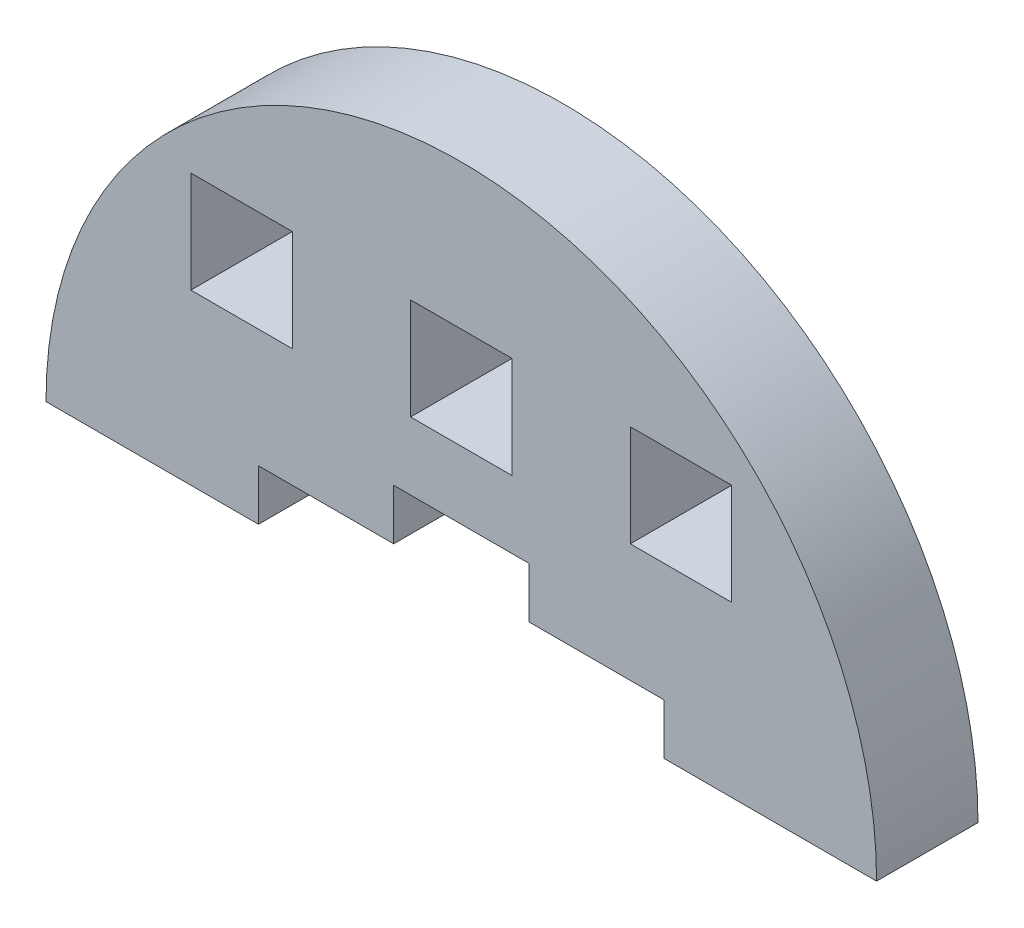
ISO-10303-21;
HEADER;
FILE_DESCRIPTION(('STEP AP214'),'2;1');
FILE_NAME('part.step','',(''),(''),'','','');
FILE_SCHEMA(('AUTOMOTIVE_DESIGN { 1 0 10303 214 1 1 1 1 }'));
ENDSEC;
DATA;
#1=APPLICATION_CONTEXT('core data for automotive mechanical design processes');
#2=APPLICATION_PROTOCOL_DEFINITION('international standard','automotive_design',2000,#1);
#3=PRODUCT_CONTEXT('',#1,'mechanical');
#4=PRODUCT('Part','Part','',(#3));
#5=PRODUCT_RELATED_PRODUCT_CATEGORY('part','',(#4));
#6=PRODUCT_DEFINITION_FORMATION('','',#4);
#7=PRODUCT_DEFINITION_CONTEXT('part definition',#1,'design');
#8=PRODUCT_DEFINITION('design','',#6,#7);
#9=PRODUCT_DEFINITION_SHAPE('','',#8);
#10=(LENGTH_UNIT() NAMED_UNIT(*) SI_UNIT(.MILLI.,.METRE.));
#11=(NAMED_UNIT(*) PLANE_ANGLE_UNIT() SI_UNIT($,.RADIAN.));
#12=(NAMED_UNIT(*) SI_UNIT($,.STERADIAN.) SOLID_ANGLE_UNIT());
#13=UNCERTAINTY_MEASURE_WITH_UNIT(LENGTH_MEASURE(1.E-05),#10,'distance_accuracy_value','');
#14=(GEOMETRIC_REPRESENTATION_CONTEXT(3) GLOBAL_UNCERTAINTY_ASSIGNED_CONTEXT((#13)) GLOBAL_UNIT_ASSIGNED_CONTEXT((#10,
#11,#12)) REPRESENTATION_CONTEXT('',''));
#15=CARTESIAN_POINT('',(0.,0.,0.));
#16=DIRECTION('',(0.,0.,1.));
#17=DIRECTION('',(1.,0.,0.));
#18=AXIS2_PLACEMENT_3D('',#15,#16,#17);
#19=CARTESIAN_POINT('',(3761.5255540209,1243.78177014644,6.));
#20=DIRECTION('',(0.,0.,1.));
#21=DIRECTION('',(1.,0.,0.));
#22=AXIS2_PLACEMENT_3D('',#19,#20,#21);
#23=PLANE('',#22);
#24=DIRECTION('',(0.,1.,0.));
#25=VECTOR('',#24,1.);
#26=CARTESIAN_POINT('',(3771.5255540209,0.,6.));
#27=LINE('',#26,#25);
#28=CARTESIAN_POINT('',(3771.5255540209,1253.78177014664,6.));
#29=VERTEX_POINT('',#28);
#30=CARTESIAN_POINT('',(3771.5255540209,1259.78177014664,6.));
#31=VERTEX_POINT('',#30);
#32=EDGE_CURVE('E363',#29,#31,#27,.T.);
#33=ORIENTED_EDGE('',*,*,#32,.T.);
#34=DIRECTION('',(1.,0.,0.));
#35=VECTOR('',#34,1.);
#36=CARTESIAN_POINT('',(0.,1259.78177014664,6.));
#37=LINE('',#36,#35);
#38=CARTESIAN_POINT('',(3777.5255540209,1259.78177014664,6.));
#39=VERTEX_POINT('',#38);
#40=EDGE_CURVE('E376',#31,#39,#37,.T.);
#41=ORIENTED_EDGE('',*,*,#40,.T.);
#42=DIRECTION('',(0.,-1.,0.));
#43=VECTOR('',#42,1.);
#44=CARTESIAN_POINT('',(3777.5255540209,0.,6.));
#45=LINE('',#44,#43);
#46=CARTESIAN_POINT('',(3777.5255540209,1253.78177014664,6.));
#47=VERTEX_POINT('',#46);
#48=EDGE_CURVE('E372',#39,#47,#45,.T.);
#49=ORIENTED_EDGE('',*,*,#48,.T.);
#50=DIRECTION('',(-1.,0.,0.));
#51=VECTOR('',#50,1.);
#52=CARTESIAN_POINT('',(0.,1253.78177014664,6.));
#53=LINE('',#52,#51);
#54=EDGE_CURVE('E367',#47,#29,#53,.T.);
#55=ORIENTED_EDGE('',*,*,#54,.T.);
#56=EDGE_LOOP('',(#33,#41,#49,#55));
#57=FACE_BOUND('',#56,.T.);
#58=DIRECTION('',(1.,0.,0.));
#59=VECTOR('',#58,1.);
#60=CARTESIAN_POINT('',(3773.5255540209,1243.78177014644,6.));
#61=LINE('',#60,#59);
#62=CARTESIAN_POINT('',(3773.5255540209,1243.78177014644,6.));
#63=VERTEX_POINT('',#62);
#64=CARTESIAN_POINT('',(3786.09698259202,1243.78177014644,6.));
#65=VERTEX_POINT('',#64);
#66=EDGE_CURVE('E450',#63,#65,#61,.T.);
#67=ORIENTED_EDGE('',*,*,#66,.T.);
#68=CARTESIAN_POINT('',(3761.5255540209,1243.78177014644,6.));
#69=DIRECTION('',(0.,0.,1.));
#70=DIRECTION('',(1.,0.,0.));
#71=AXIS2_PLACEMENT_3D('',#68,#69,#70);
#72=CIRCLE('',#71,24.5714285711283);
#73=CARTESIAN_POINT('',(3736.95412544977,1243.78177014644,6.));
#74=VERTEX_POINT('',#73);
#75=EDGE_CURVE('E454',#65,#74,#72,.T.);
#76=ORIENTED_EDGE('',*,*,#75,.T.);
#77=DIRECTION('',(1.,0.,0.));
#78=VECTOR('',#77,1.);
#79=CARTESIAN_POINT('',(3736.95412544977,1243.78177014644,6.));
#80=LINE('',#79,#78);
#81=CARTESIAN_POINT('',(3749.5255540209,1243.78177014644,6.));
#82=VERTEX_POINT('',#81);
#83=EDGE_CURVE('E458',#74,#82,#80,.T.);
#84=ORIENTED_EDGE('',*,*,#83,.T.);
#85=DIRECTION('',(0.,-1.,0.));
#86=VECTOR('',#85,1.);
#87=CARTESIAN_POINT('',(3749.5255540209,1246.78177014644,6.));
#88=LINE('',#87,#86);
#89=CARTESIAN_POINT('',(3749.5255540209,1246.78177014644,6.));
#90=VERTEX_POINT('',#89);
#91=EDGE_CURVE('E461',#90,#82,#88,.T.);
#92=ORIENTED_EDGE('',*,*,#91,.F.);
#93=DIRECTION('',(-1.,0.,0.));
#94=VECTOR('',#93,1.);
#95=CARTESIAN_POINT('',(3757.5255540209,1246.78177014644,6.));
#96=LINE('',#95,#94);
#97=CARTESIAN_POINT('',(3757.5255540209,1246.78177014644,6.));
#98=VERTEX_POINT('',#97);
#99=EDGE_CURVE('E465',#98,#90,#96,.T.);
#100=ORIENTED_EDGE('',*,*,#99,.F.);
#101=DIRECTION('',(0.,-1.,0.));
#102=VECTOR('',#101,1.);
#103=CARTESIAN_POINT('',(3757.5255540209,1249.78177014644,6.));
#104=LINE('',#103,#102);
#105=CARTESIAN_POINT('',(3757.5255540209,1249.78177014644,6.));
#106=VERTEX_POINT('',#105);
#107=EDGE_CURVE('E469',#106,#98,#104,.T.);
#108=ORIENTED_EDGE('',*,*,#107,.F.);
#109=DIRECTION('',(1.,0.,0.));
#110=VECTOR('',#109,1.);
#111=CARTESIAN_POINT('',(3757.5255540209,1249.78177014644,6.));
#112=LINE('',#111,#110);
#113=CARTESIAN_POINT('',(3765.5255540209,1249.78177014644,6.));
#114=VERTEX_POINT('',#113);
#115=EDGE_CURVE('E473',#106,#114,#112,.T.);
#116=ORIENTED_EDGE('',*,*,#115,.T.);
#117=DIRECTION('',(0.,-1.,0.));
#118=VECTOR('',#117,1.);
#119=CARTESIAN_POINT('',(3765.5255540209,1249.78177014644,6.));
#120=LINE('',#119,#118);
#121=CARTESIAN_POINT('',(3765.5255540209,1246.78177014644,6.));
#122=VERTEX_POINT('',#121);
#123=EDGE_CURVE('E476',#114,#122,#120,.T.);
#124=ORIENTED_EDGE('',*,*,#123,.T.);
#125=DIRECTION('',(1.,0.,0.));
#126=VECTOR('',#125,1.);
#127=CARTESIAN_POINT('',(3765.5255540209,1246.78177014644,6.));
#128=LINE('',#127,#126);
#129=CARTESIAN_POINT('',(3773.5255540209,1246.78177014644,6.));
#130=VERTEX_POINT('',#129);
#131=EDGE_CURVE('E479',#122,#130,#128,.T.);
#132=ORIENTED_EDGE('',*,*,#131,.T.);
#133=DIRECTION('',(0.,-1.,0.));
#134=VECTOR('',#133,1.);
#135=CARTESIAN_POINT('',(3773.5255540209,1246.78177014644,6.));
#136=LINE('',#135,#134);
#137=EDGE_CURVE('E482',#130,#63,#136,.T.);
#138=ORIENTED_EDGE('',*,*,#137,.T.);
#139=EDGE_LOOP('',(#67,#76,#84,#92,#100,#108,#116,#124,#132,#138));
#140=FACE_BOUND('',#139,.T.);
#141=DIRECTION('',(0.,1.,0.));
#142=VECTOR('',#141,1.);
#143=CARTESIAN_POINT('',(3751.5255540209,0.,6.));
#144=LINE('',#143,#142);
#145=CARTESIAN_POINT('',(3751.5255540209,1253.78177014664,6.));
#146=VERTEX_POINT('',#145);
#147=CARTESIAN_POINT('',(3751.5255540209,1259.78177014664,6.));
#148=VERTEX_POINT('',#147);
#149=EDGE_CURVE('E410',#146,#148,#144,.T.);
#150=ORIENTED_EDGE('',*,*,#149,.F.);
#151=DIRECTION('',(1.,0.,0.));
#152=VECTOR('',#151,1.);
#153=CARTESIAN_POINT('',(0.,1253.78177014664,6.));
#154=LINE('',#153,#152);
#155=CARTESIAN_POINT('',(3745.5255540209,1253.78177014664,6.));
#156=VERTEX_POINT('',#155);
#157=EDGE_CURVE('E407',#156,#146,#154,.T.);
#158=ORIENTED_EDGE('',*,*,#157,.F.);
#159=DIRECTION('',(0.,-1.,0.));
#160=VECTOR('',#159,1.);
#161=CARTESIAN_POINT('',(3745.5255540209,0.,6.));
#162=LINE('',#161,#160);
#163=CARTESIAN_POINT('',(3745.5255540209,1259.78177014664,6.));
#164=VERTEX_POINT('',#163);
#165=EDGE_CURVE('E418',#164,#156,#162,.T.);
#166=ORIENTED_EDGE('',*,*,#165,.F.);
#167=DIRECTION('',(-1.,0.,0.));
#168=VECTOR('',#167,1.);
#169=CARTESIAN_POINT('',(0.,1259.78177014664,6.));
#170=LINE('',#169,#168);
#171=EDGE_CURVE('E414',#148,#164,#170,.T.);
#172=ORIENTED_EDGE('',*,*,#171,.F.);
#173=EDGE_LOOP('',(#150,#158,#166,#172));
#174=FACE_BOUND('',#173,.T.);
#175=DIRECTION('',(0.,-1.,0.));
#176=VECTOR('',#175,1.);
#177=CARTESIAN_POINT('',(3758.5255540209,1259.78177014664,6.));
#178=LINE('',#177,#176);
#179=CARTESIAN_POINT('',(3758.5255540209,1259.78177014664,6.));
#180=VERTEX_POINT('',#179);
#181=CARTESIAN_POINT('',(3758.5255540209,1253.78177014664,6.));
#182=VERTEX_POINT('',#181);
#183=EDGE_CURVE('E324',#180,#182,#178,.T.);
#184=ORIENTED_EDGE('',*,*,#183,.F.);
#185=DIRECTION('',(-1.,0.,0.));
#186=VECTOR('',#185,1.);
#187=CARTESIAN_POINT('',(3764.5255540209,1259.78177014664,6.));
#188=LINE('',#187,#186);
#189=CARTESIAN_POINT('',(3764.5255540209,1259.78177014664,6.));
#190=VERTEX_POINT('',#189);
#191=EDGE_CURVE('E315',#190,#180,#188,.T.);
#192=ORIENTED_EDGE('',*,*,#191,.F.);
#193=DIRECTION('',(0.,1.,0.));
#194=VECTOR('',#193,1.);
#195=CARTESIAN_POINT('',(3764.5255540209,1253.78177014664,6.));
#196=LINE('',#195,#194);
#197=CARTESIAN_POINT('',(3764.5255540209,1253.78177014664,6.));
#198=VERTEX_POINT('',#197);
#199=EDGE_CURVE('E341',#198,#190,#196,.T.);
#200=ORIENTED_EDGE('',*,*,#199,.F.);
#201=DIRECTION('',(1.,0.,0.));
#202=VECTOR('',#201,1.);
#203=CARTESIAN_POINT('',(3758.5255540209,1253.78177014664,6.));
#204=LINE('',#203,#202);
#205=EDGE_CURVE('E337',#182,#198,#204,.T.);
#206=ORIENTED_EDGE('',*,*,#205,.F.);
#207=EDGE_LOOP('',(#184,#192,#200,#206));
#208=FACE_BOUND('',#207,.T.);
#209=ADVANCED_FACE('F165',(#57,#140,#174,#208),#23,.T.);
#210=CARTESIAN_POINT('',(3761.5255540209,1243.78177014644,0.));
#211=DIRECTION('',(0.,0.,1.));
#212=DIRECTION('',(1.,0.,0.));
#213=AXIS2_PLACEMENT_3D('',#210,#211,#212);
#214=PLANE('',#213);
#215=DIRECTION('',(1.,0.,0.));
#216=VECTOR('',#215,1.);
#217=CARTESIAN_POINT('',(0.,1253.78177014664,0.));
#218=LINE('',#217,#216);
#219=CARTESIAN_POINT('',(3745.5255540209,1253.78177014664,0.));
#220=VERTEX_POINT('',#219);
#221=CARTESIAN_POINT('',(3751.5255540209,1253.78177014664,0.));
#222=VERTEX_POINT('',#221);
#223=EDGE_CURVE('E406',#220,#222,#218,.T.);
#224=ORIENTED_EDGE('',*,*,#223,.T.);
#225=DIRECTION('',(0.,1.,0.));
#226=VECTOR('',#225,1.);
#227=CARTESIAN_POINT('',(3751.5255540209,0.,0.));
#228=LINE('',#227,#226);
#229=CARTESIAN_POINT('',(3751.5255540209,1259.78177014664,0.));
#230=VERTEX_POINT('',#229);
#231=EDGE_CURVE('E425',#222,#230,#228,.T.);
#232=ORIENTED_EDGE('',*,*,#231,.T.);
#233=DIRECTION('',(-1.,0.,0.));
#234=VECTOR('',#233,1.);
#235=CARTESIAN_POINT('',(0.,1259.78177014664,0.));
#236=LINE('',#235,#234);
#237=CARTESIAN_POINT('',(3745.5255540209,1259.78177014664,0.));
#238=VERTEX_POINT('',#237);
#239=EDGE_CURVE('E429',#230,#238,#236,.T.);
#240=ORIENTED_EDGE('',*,*,#239,.T.);
#241=DIRECTION('',(0.,-1.,0.));
#242=VECTOR('',#241,1.);
#243=CARTESIAN_POINT('',(3745.5255540209,0.,0.));
#244=LINE('',#243,#242);
#245=EDGE_CURVE('E411',#238,#220,#244,.T.);
#246=ORIENTED_EDGE('',*,*,#245,.T.);
#247=EDGE_LOOP('',(#224,#232,#240,#246));
#248=FACE_BOUND('',#247,.T.);
#249=DIRECTION('',(1.,0.,0.));
#250=VECTOR('',#249,1.);
#251=CARTESIAN_POINT('',(3773.5255540209,1243.78177014644,0.));
#252=LINE('',#251,#250);
#253=CARTESIAN_POINT('',(3773.5255540209,1243.78177014644,0.));
#254=VERTEX_POINT('',#253);
#255=CARTESIAN_POINT('',(3786.09698259202,1243.78177014644,0.));
#256=VERTEX_POINT('',#255);
#257=EDGE_CURVE('E449',#254,#256,#252,.T.);
#258=ORIENTED_EDGE('',*,*,#257,.F.);
#259=DIRECTION('',(0.,-1.,0.));
#260=VECTOR('',#259,1.);
#261=CARTESIAN_POINT('',(3773.5255540209,1246.78177014644,0.));
#262=LINE('',#261,#260);
#263=CARTESIAN_POINT('',(3773.5255540209,1246.78177014644,0.));
#264=VERTEX_POINT('',#263);
#265=EDGE_CURVE('E455',#264,#254,#262,.T.);
#266=ORIENTED_EDGE('',*,*,#265,.F.);
#267=DIRECTION('',(1.,0.,0.));
#268=VECTOR('',#267,1.);
#269=CARTESIAN_POINT('',(3765.5255540209,1246.78177014644,0.));
#270=LINE('',#269,#268);
#271=CARTESIAN_POINT('',(3765.5255540209,1246.78177014644,0.));
#272=VERTEX_POINT('',#271);
#273=EDGE_CURVE('E514',#272,#264,#270,.T.);
#274=ORIENTED_EDGE('',*,*,#273,.F.);
#275=DIRECTION('',(0.,-1.,0.));
#276=VECTOR('',#275,1.);
#277=CARTESIAN_POINT('',(3765.5255540209,1249.78177014644,0.));
#278=LINE('',#277,#276);
#279=CARTESIAN_POINT('',(3765.5255540209,1249.78177014644,0.));
#280=VERTEX_POINT('',#279);
#281=EDGE_CURVE('E511',#280,#272,#278,.T.);
#282=ORIENTED_EDGE('',*,*,#281,.F.);
#283=DIRECTION('',(1.,0.,0.));
#284=VECTOR('',#283,1.);
#285=CARTESIAN_POINT('',(3757.5255540209,1249.78177014644,0.));
#286=LINE('',#285,#284);
#287=CARTESIAN_POINT('',(3757.5255540209,1249.78177014644,0.));
#288=VERTEX_POINT('',#287);
#289=EDGE_CURVE('E508',#288,#280,#286,.T.);
#290=ORIENTED_EDGE('',*,*,#289,.F.);
#291=DIRECTION('',(0.,-1.,0.));
#292=VECTOR('',#291,1.);
#293=CARTESIAN_POINT('',(3757.5255540209,1249.78177014644,0.));
#294=LINE('',#293,#292);
#295=CARTESIAN_POINT('',(3757.5255540209,1246.78177014644,0.));
#296=VERTEX_POINT('',#295);
#297=EDGE_CURVE('E504',#288,#296,#294,.T.);
#298=ORIENTED_EDGE('',*,*,#297,.T.);
#299=DIRECTION('',(-1.,0.,0.));
#300=VECTOR('',#299,1.);
#301=CARTESIAN_POINT('',(3757.5255540209,1246.78177014644,0.));
#302=LINE('',#301,#300);
#303=CARTESIAN_POINT('',(3749.5255540209,1246.78177014644,0.));
#304=VERTEX_POINT('',#303);
#305=EDGE_CURVE('E500',#296,#304,#302,.T.);
#306=ORIENTED_EDGE('',*,*,#305,.T.);
#307=DIRECTION('',(0.,-1.,0.));
#308=VECTOR('',#307,1.);
#309=CARTESIAN_POINT('',(3749.5255540209,1246.78177014644,0.));
#310=LINE('',#309,#308);
#311=CARTESIAN_POINT('',(3749.5255540209,1243.78177014644,0.));
#312=VERTEX_POINT('',#311);
#313=EDGE_CURVE('E496',#304,#312,#310,.T.);
#314=ORIENTED_EDGE('',*,*,#313,.T.);
#315=DIRECTION('',(1.,0.,0.));
#316=VECTOR('',#315,1.);
#317=CARTESIAN_POINT('',(3736.95412544977,1243.78177014644,0.));
#318=LINE('',#317,#316);
#319=CARTESIAN_POINT('',(3736.95412544977,1243.78177014644,0.));
#320=VERTEX_POINT('',#319);
#321=EDGE_CURVE('E492',#320,#312,#318,.T.);
#322=ORIENTED_EDGE('',*,*,#321,.F.);
#323=CARTESIAN_POINT('',(3761.5255540209,1243.78177014644,0.));
#324=DIRECTION('',(0.,0.,1.));
#325=DIRECTION('',(1.,0.,0.));
#326=AXIS2_PLACEMENT_3D('',#323,#324,#325);
#327=CIRCLE('',#326,24.5714285711283);
#328=EDGE_CURVE('E489',#256,#320,#327,.T.);
#329=ORIENTED_EDGE('',*,*,#328,.F.);
#330=EDGE_LOOP('',(#258,#266,#274,#282,#290,#298,#306,#314,#322,#329));
#331=FACE_BOUND('',#330,.T.);
#332=DIRECTION('',(1.,0.,0.));
#333=VECTOR('',#332,1.);
#334=CARTESIAN_POINT('',(0.,1259.78177014664,0.));
#335=LINE('',#334,#333);
#336=CARTESIAN_POINT('',(3771.5255540209,1259.78177014664,0.));
#337=VERTEX_POINT('',#336);
#338=CARTESIAN_POINT('',(3777.5255540209,1259.78177014664,0.));
#339=VERTEX_POINT('',#338);
#340=EDGE_CURVE('E368',#337,#339,#335,.T.);
#341=ORIENTED_EDGE('',*,*,#340,.F.);
#342=DIRECTION('',(0.,1.,0.));
#343=VECTOR('',#342,1.);
#344=CARTESIAN_POINT('',(3771.5255540209,0.,0.));
#345=LINE('',#344,#343);
#346=CARTESIAN_POINT('',(3771.5255540209,1253.78177014664,0.));
#347=VERTEX_POINT('',#346);
#348=EDGE_CURVE('E333',#347,#337,#345,.T.);
#349=ORIENTED_EDGE('',*,*,#348,.F.);
#350=DIRECTION('',(-1.,0.,0.));
#351=VECTOR('',#350,1.);
#352=CARTESIAN_POINT('',(0.,1253.78177014664,0.));
#353=LINE('',#352,#351);
#354=CARTESIAN_POINT('',(3777.5255540209,1253.78177014664,0.));
#355=VERTEX_POINT('',#354);
#356=EDGE_CURVE('E383',#355,#347,#353,.T.);
#357=ORIENTED_EDGE('',*,*,#356,.F.);
#358=DIRECTION('',(0.,-1.,0.));
#359=VECTOR('',#358,1.);
#360=CARTESIAN_POINT('',(3777.5255540209,0.,0.));
#361=LINE('',#360,#359);
#362=EDGE_CURVE('E387',#339,#355,#361,.T.);
#363=ORIENTED_EDGE('',*,*,#362,.F.);
#364=EDGE_LOOP('',(#341,#349,#357,#363));
#365=FACE_BOUND('',#364,.T.);
#366=DIRECTION('',(-1.,0.,0.));
#367=VECTOR('',#366,1.);
#368=CARTESIAN_POINT('',(3764.5255540209,1259.78177014664,0.));
#369=LINE('',#368,#367);
#370=CARTESIAN_POINT('',(3764.5255540209,1259.78177014664,0.));
#371=VERTEX_POINT('',#370);
#372=CARTESIAN_POINT('',(3758.5255540209,1259.78177014664,0.));
#373=VERTEX_POINT('',#372);
#374=EDGE_CURVE('E189',#371,#373,#369,.T.);
#375=ORIENTED_EDGE('',*,*,#374,.T.);
#376=DIRECTION('',(0.,-1.,0.));
#377=VECTOR('',#376,1.);
#378=CARTESIAN_POINT('',(3758.5255540209,1259.78177014664,0.));
#379=LINE('',#378,#377);
#380=CARTESIAN_POINT('',(3758.5255540209,1253.78177014664,0.));
#381=VERTEX_POINT('',#380);
#382=EDGE_CURVE('E331',#373,#381,#379,.T.);
#383=ORIENTED_EDGE('',*,*,#382,.T.);
#384=DIRECTION('',(1.,0.,0.));
#385=VECTOR('',#384,1.);
#386=CARTESIAN_POINT('',(3758.5255540209,1253.78177014664,0.));
#387=LINE('',#386,#385);
#388=CARTESIAN_POINT('',(3764.5255540209,1253.78177014664,0.));
#389=VERTEX_POINT('',#388);
#390=EDGE_CURVE('E350',#381,#389,#387,.T.);
#391=ORIENTED_EDGE('',*,*,#390,.T.);
#392=DIRECTION('',(0.,1.,0.));
#393=VECTOR('',#392,1.);
#394=CARTESIAN_POINT('',(3764.5255540209,1253.78177014664,0.));
#395=LINE('',#394,#393);
#396=EDGE_CURVE('E325',#389,#371,#395,.T.);
#397=ORIENTED_EDGE('',*,*,#396,.T.);
#398=EDGE_LOOP('',(#375,#383,#391,#397));
#399=FACE_BOUND('',#398,.T.);
#400=ADVANCED_FACE('F556',(#248,#331,#365,#399),#214,.F.);
#401=CARTESIAN_POINT('',(3773.5255540209,1243.78177014644,6.));
#402=DIRECTION('',(0.,1.,0.));
#403=DIRECTION('',(0.,0.,1.));
#404=AXIS2_PLACEMENT_3D('',#401,#402,#403);
#405=PLANE('',#404);
#406=ORIENTED_EDGE('',*,*,#257,.T.);
#407=DIRECTION('',(0.,0.,-1.));
#408=VECTOR('',#407,1.);
#409=CARTESIAN_POINT('',(3786.09698259202,1243.78177014644,6.));
#410=LINE('',#409,#408);
#411=EDGE_CURVE('E12',#65,#256,#410,.T.);
#412=ORIENTED_EDGE('',*,*,#411,.F.);
#413=ORIENTED_EDGE('',*,*,#66,.F.);
#414=DIRECTION('',(0.,0.,-1.));
#415=VECTOR('',#414,1.);
#416=CARTESIAN_POINT('',(3773.5255540209,1243.78177014644,6.));
#417=LINE('',#416,#415);
#418=EDGE_CURVE('E485',#63,#254,#417,.T.);
#419=ORIENTED_EDGE('',*,*,#418,.T.);
#420=EDGE_LOOP('',(#406,#412,#413,#419));
#421=FACE_BOUND('',#420,.T.);
#422=ADVANCED_FACE('F167',(#421),#405,.F.);
#423=CARTESIAN_POINT('',(3761.5255540209,1243.78177014644,6.));
#424=DIRECTION('',(0.,0.,-1.));
#425=DIRECTION('',(-1.,0.,0.));
#426=AXIS2_PLACEMENT_3D('',#423,#424,#425);
#427=CYLINDRICAL_SURFACE('',#426,24.5714285711283);
#428=ORIENTED_EDGE('',*,*,#328,.T.);
#429=DIRECTION('',(0.,0.,-1.));
#430=VECTOR('',#429,1.);
#431=CARTESIAN_POINT('',(3736.95412544977,1243.78177014644,6.));
#432=LINE('',#431,#430);
#433=EDGE_CURVE('E174',#74,#320,#432,.T.);
#434=ORIENTED_EDGE('',*,*,#433,.F.);
#435=ORIENTED_EDGE('',*,*,#75,.F.);
#436=ORIENTED_EDGE('',*,*,#411,.T.);
#437=EDGE_LOOP('',(#428,#434,#435,#436));
#438=FACE_BOUND('',#437,.T.);
#439=ADVANCED_FACE('F595',(#438),#427,.T.);
#440=CARTESIAN_POINT('',(3736.95412544977,1243.78177014644,6.));
#441=DIRECTION('',(0.,1.,0.));
#442=DIRECTION('',(0.,0.,1.));
#443=AXIS2_PLACEMENT_3D('',#440,#441,#442);
#444=PLANE('',#443);
#445=ORIENTED_EDGE('',*,*,#321,.T.);
#446=DIRECTION('',(0.,0.,-1.));
#447=VECTOR('',#446,1.);
#448=CARTESIAN_POINT('',(3749.5255540209,1243.78177014644,6.));
#449=LINE('',#448,#447);
#450=EDGE_CURVE('E543',#82,#312,#449,.T.);
#451=ORIENTED_EDGE('',*,*,#450,.F.);
#452=ORIENTED_EDGE('',*,*,#83,.F.);
#453=ORIENTED_EDGE('',*,*,#433,.T.);
#454=EDGE_LOOP('',(#445,#451,#452,#453));
#455=FACE_BOUND('',#454,.T.);
#456=ADVANCED_FACE('F551',(#455),#444,.F.);
#457=CARTESIAN_POINT('',(3749.5255540209,1246.78177014644,6.));
#458=DIRECTION('',(1.,0.,0.));
#459=DIRECTION('',(0.,0.,-1.));
#460=AXIS2_PLACEMENT_3D('',#457,#458,#459);
#461=PLANE('',#460);
#462=ORIENTED_EDGE('',*,*,#313,.F.);
#463=DIRECTION('',(0.,0.,-1.));
#464=VECTOR('',#463,1.);
#465=CARTESIAN_POINT('',(3749.5255540209,1246.78177014644,6.));
#466=LINE('',#465,#464);
#467=EDGE_CURVE('E540',#90,#304,#466,.T.);
#468=ORIENTED_EDGE('',*,*,#467,.F.);
#469=ORIENTED_EDGE('',*,*,#91,.T.);
#470=ORIENTED_EDGE('',*,*,#450,.T.);
#471=EDGE_LOOP('',(#462,#468,#469,#470));
#472=FACE_BOUND('',#471,.T.);
#473=ADVANCED_FACE('F561',(#472),#461,.T.);
#474=CARTESIAN_POINT('',(3757.5255540209,1246.78177014644,6.));
#475=DIRECTION('',(0.,-1.,0.));
#476=DIRECTION('',(0.,0.,-1.));
#477=AXIS2_PLACEMENT_3D('',#474,#475,#476);
#478=PLANE('',#477);
#479=ORIENTED_EDGE('',*,*,#305,.F.);
#480=DIRECTION('',(0.,0.,-1.));
#481=VECTOR('',#480,1.);
#482=CARTESIAN_POINT('',(3757.5255540209,1246.78177014644,6.));
#483=LINE('',#482,#481);
#484=EDGE_CURVE('E537',#98,#296,#483,.T.);
#485=ORIENTED_EDGE('',*,*,#484,.F.);
#486=ORIENTED_EDGE('',*,*,#99,.T.);
#487=ORIENTED_EDGE('',*,*,#467,.T.);
#488=EDGE_LOOP('',(#479,#485,#486,#487));
#489=FACE_BOUND('',#488,.T.);
#490=ADVANCED_FACE('F568',(#489),#478,.T.);
#491=CARTESIAN_POINT('',(3757.5255540209,1249.78177014644,6.));
#492=DIRECTION('',(1.,0.,0.));
#493=DIRECTION('',(0.,0.,-1.));
#494=AXIS2_PLACEMENT_3D('',#491,#492,#493);
#495=PLANE('',#494);
#496=ORIENTED_EDGE('',*,*,#297,.F.);
#497=DIRECTION('',(0.,0.,-1.));
#498=VECTOR('',#497,1.);
#499=CARTESIAN_POINT('',(3757.5255540209,1249.78177014644,6.));
#500=LINE('',#499,#498);
#501=EDGE_CURVE('E534',#106,#288,#500,.T.);
#502=ORIENTED_EDGE('',*,*,#501,.F.);
#503=ORIENTED_EDGE('',*,*,#107,.T.);
#504=ORIENTED_EDGE('',*,*,#484,.T.);
#505=EDGE_LOOP('',(#496,#502,#503,#504));
#506=FACE_BOUND('',#505,.T.);
#507=ADVANCED_FACE('F571',(#506),#495,.T.);
#508=CARTESIAN_POINT('',(3757.5255540209,1249.78177014644,6.));
#509=DIRECTION('',(0.,1.,0.));
#510=DIRECTION('',(0.,0.,1.));
#511=AXIS2_PLACEMENT_3D('',#508,#509,#510);
#512=PLANE('',#511);
#513=ORIENTED_EDGE('',*,*,#289,.T.);
#514=DIRECTION('',(0.,0.,-1.));
#515=VECTOR('',#514,1.);
#516=CARTESIAN_POINT('',(3765.5255540209,1249.78177014644,6.));
#517=LINE('',#516,#515);
#518=EDGE_CURVE('E530',#114,#280,#517,.T.);
#519=ORIENTED_EDGE('',*,*,#518,.F.);
#520=ORIENTED_EDGE('',*,*,#115,.F.);
#521=ORIENTED_EDGE('',*,*,#501,.T.);
#522=EDGE_LOOP('',(#513,#519,#520,#521));
#523=FACE_BOUND('',#522,.T.);
#524=ADVANCED_FACE('F577',(#523),#512,.F.);
#525=CARTESIAN_POINT('',(3765.5255540209,1249.78177014644,6.));
#526=DIRECTION('',(1.,0.,0.));
#527=DIRECTION('',(0.,0.,-1.));
#528=AXIS2_PLACEMENT_3D('',#525,#526,#527);
#529=PLANE('',#528);
#530=ORIENTED_EDGE('',*,*,#281,.T.);
#531=DIRECTION('',(0.,0.,-1.));
#532=VECTOR('',#531,1.);
#533=CARTESIAN_POINT('',(3765.5255540209,1246.78177014644,6.));
#534=LINE('',#533,#532);
#535=EDGE_CURVE('E526',#122,#272,#534,.T.);
#536=ORIENTED_EDGE('',*,*,#535,.F.);
#537=ORIENTED_EDGE('',*,*,#123,.F.);
#538=ORIENTED_EDGE('',*,*,#518,.T.);
#539=EDGE_LOOP('',(#530,#536,#537,#538));
#540=FACE_BOUND('',#539,.T.);
#541=ADVANCED_FACE('F581',(#540),#529,.F.);
#542=CARTESIAN_POINT('',(3765.5255540209,1246.78177014644,6.));
#543=DIRECTION('',(0.,1.,0.));
#544=DIRECTION('',(0.,0.,1.));
#545=AXIS2_PLACEMENT_3D('',#542,#543,#544);
#546=PLANE('',#545);
#547=ORIENTED_EDGE('',*,*,#273,.T.);
#548=DIRECTION('',(0.,0.,-1.));
#549=VECTOR('',#548,1.);
#550=CARTESIAN_POINT('',(3773.5255540209,1246.78177014644,6.));
#551=LINE('',#550,#549);
#552=EDGE_CURVE('E522',#130,#264,#551,.T.);
#553=ORIENTED_EDGE('',*,*,#552,.F.);
#554=ORIENTED_EDGE('',*,*,#131,.F.);
#555=ORIENTED_EDGE('',*,*,#535,.T.);
#556=EDGE_LOOP('',(#547,#553,#554,#555));
#557=FACE_BOUND('',#556,.T.);
#558=ADVANCED_FACE('F586',(#557),#546,.F.);
#559=CARTESIAN_POINT('',(3773.5255540209,1246.78177014644,6.));
#560=DIRECTION('',(1.,0.,0.));
#561=DIRECTION('',(0.,0.,-1.));
#562=AXIS2_PLACEMENT_3D('',#559,#560,#561);
#563=PLANE('',#562);
#564=ORIENTED_EDGE('',*,*,#265,.T.);
#565=ORIENTED_EDGE('',*,*,#418,.F.);
#566=ORIENTED_EDGE('',*,*,#137,.F.);
#567=ORIENTED_EDGE('',*,*,#552,.T.);
#568=EDGE_LOOP('',(#564,#565,#566,#567));
#569=FACE_BOUND('',#568,.T.);
#570=ADVANCED_FACE('F592',(#569),#563,.F.);
#571=CARTESIAN_POINT('',(0.,1253.78177014664,6.));
#572=DIRECTION('',(0.,1.,0.));
#573=DIRECTION('',(0.,0.,1.));
#574=AXIS2_PLACEMENT_3D('',#571,#572,#573);
#575=PLANE('',#574);
#576=ORIENTED_EDGE('',*,*,#223,.F.);
#577=DIRECTION('',(0.,0.,-1.));
#578=VECTOR('',#577,1.);
#579=CARTESIAN_POINT('',(3745.5255540209,1253.78177014664,6.));
#580=LINE('',#579,#578);
#581=EDGE_CURVE('E421',#156,#220,#580,.T.);
#582=ORIENTED_EDGE('',*,*,#581,.F.);
#583=ORIENTED_EDGE('',*,*,#157,.T.);
#584=DIRECTION('',(0.,0.,-1.));
#585=VECTOR('',#584,1.);
#586=CARTESIAN_POINT('',(3751.5255540209,1253.78177014664,6.));
#587=LINE('',#586,#585);
#588=EDGE_CURVE('E445',#146,#222,#587,.T.);
#589=ORIENTED_EDGE('',*,*,#588,.T.);
#590=EDGE_LOOP('',(#576,#582,#583,#589));
#591=FACE_BOUND('',#590,.T.);
#592=ADVANCED_FACE('F611',(#591),#575,.T.);
#593=CARTESIAN_POINT('',(3751.5255540209,0.,6.));
#594=DIRECTION('',(-1.,0.,0.));
#595=DIRECTION('',(0.,0.,1.));
#596=AXIS2_PLACEMENT_3D('',#593,#594,#595);
#597=PLANE('',#596);
#598=ORIENTED_EDGE('',*,*,#231,.F.);
#599=ORIENTED_EDGE('',*,*,#588,.F.);
#600=ORIENTED_EDGE('',*,*,#149,.T.);
#601=DIRECTION('',(0.,0.,-1.));
#602=VECTOR('',#601,1.);
#603=CARTESIAN_POINT('',(3751.5255540209,1259.78177014664,6.));
#604=LINE('',#603,#602);
#605=EDGE_CURVE('E442',#148,#230,#604,.T.);
#606=ORIENTED_EDGE('',*,*,#605,.T.);
#607=EDGE_LOOP('',(#598,#599,#600,#606));
#608=FACE_BOUND('',#607,.T.);
#609=ADVANCED_FACE('F661',(#608),#597,.T.);
#610=CARTESIAN_POINT('',(0.,1259.78177014664,6.));
#611=DIRECTION('',(0.,-1.,0.));
#612=DIRECTION('',(0.,0.,-1.));
#613=AXIS2_PLACEMENT_3D('',#610,#611,#612);
#614=PLANE('',#613);
#615=ORIENTED_EDGE('',*,*,#239,.F.);
#616=ORIENTED_EDGE('',*,*,#605,.F.);
#617=ORIENTED_EDGE('',*,*,#171,.T.);
#618=DIRECTION('',(0.,0.,-1.));
#619=VECTOR('',#618,1.);
#620=CARTESIAN_POINT('',(3745.5255540209,1259.78177014664,6.));
#621=LINE('',#620,#619);
#622=EDGE_CURVE('E439',#164,#238,#621,.T.);
#623=ORIENTED_EDGE('',*,*,#622,.T.);
#624=EDGE_LOOP('',(#615,#616,#617,#623));
#625=FACE_BOUND('',#624,.T.);
#626=ADVANCED_FACE('F668',(#625),#614,.T.);
#627=CARTESIAN_POINT('',(3745.5255540209,0.,6.));
#628=DIRECTION('',(1.,0.,0.));
#629=DIRECTION('',(0.,0.,-1.));
#630=AXIS2_PLACEMENT_3D('',#627,#628,#629);
#631=PLANE('',#630);
#632=ORIENTED_EDGE('',*,*,#245,.F.);
#633=ORIENTED_EDGE('',*,*,#622,.F.);
#634=ORIENTED_EDGE('',*,*,#165,.T.);
#635=ORIENTED_EDGE('',*,*,#581,.T.);
#636=EDGE_LOOP('',(#632,#633,#634,#635));
#637=FACE_BOUND('',#636,.T.);
#638=ADVANCED_FACE('F675',(#637),#631,.T.);
#639=CARTESIAN_POINT('',(3771.5255540209,0.,6.));
#640=DIRECTION('',(-1.,0.,0.));
#641=DIRECTION('',(0.,0.,1.));
#642=AXIS2_PLACEMENT_3D('',#639,#640,#641);
#643=PLANE('',#642);
#644=ORIENTED_EDGE('',*,*,#348,.T.);
#645=DIRECTION('',(0.,0.,-1.));
#646=VECTOR('',#645,1.);
#647=CARTESIAN_POINT('',(3771.5255540209,1259.78177014664,6.));
#648=LINE('',#647,#646);
#649=EDGE_CURVE('E380',#31,#337,#648,.T.);
#650=ORIENTED_EDGE('',*,*,#649,.F.);
#651=ORIENTED_EDGE('',*,*,#32,.F.);
#652=DIRECTION('',(0.,0.,-1.));
#653=VECTOR('',#652,1.);
#654=CARTESIAN_POINT('',(3771.5255540209,1253.78177014664,6.));
#655=LINE('',#654,#653);
#656=EDGE_CURVE('E403',#29,#347,#655,.T.);
#657=ORIENTED_EDGE('',*,*,#656,.T.);
#658=EDGE_LOOP('',(#644,#650,#651,#657));
#659=FACE_BOUND('',#658,.T.);
#660=ADVANCED_FACE('F683',(#659),#643,.F.);
#661=CARTESIAN_POINT('',(0.,1253.78177014664,6.));
#662=DIRECTION('',(0.,-1.,0.));
#663=DIRECTION('',(0.,0.,-1.));
#664=AXIS2_PLACEMENT_3D('',#661,#662,#663);
#665=PLANE('',#664);
#666=ORIENTED_EDGE('',*,*,#356,.T.);
#667=ORIENTED_EDGE('',*,*,#656,.F.);
#668=ORIENTED_EDGE('',*,*,#54,.F.);
#669=DIRECTION('',(0.,0.,-1.));
#670=VECTOR('',#669,1.);
#671=CARTESIAN_POINT('',(3777.5255540209,1253.78177014664,6.));
#672=LINE('',#671,#670);
#673=EDGE_CURVE('E400',#47,#355,#672,.T.);
#674=ORIENTED_EDGE('',*,*,#673,.T.);
#675=EDGE_LOOP('',(#666,#667,#668,#674));
#676=FACE_BOUND('',#675,.T.);
#677=ADVANCED_FACE('F691',(#676),#665,.F.);
#678=CARTESIAN_POINT('',(3777.5255540209,0.,6.));
#679=DIRECTION('',(1.,0.,0.));
#680=DIRECTION('',(0.,0.,-1.));
#681=AXIS2_PLACEMENT_3D('',#678,#679,#680);
#682=PLANE('',#681);
#683=ORIENTED_EDGE('',*,*,#362,.T.);
#684=ORIENTED_EDGE('',*,*,#673,.F.);
#685=ORIENTED_EDGE('',*,*,#48,.F.);
#686=DIRECTION('',(0.,0.,-1.));
#687=VECTOR('',#686,1.);
#688=CARTESIAN_POINT('',(3777.5255540209,1259.78177014664,6.));
#689=LINE('',#688,#687);
#690=EDGE_CURVE('E397',#39,#339,#689,.T.);
#691=ORIENTED_EDGE('',*,*,#690,.T.);
#692=EDGE_LOOP('',(#683,#684,#685,#691));
#693=FACE_BOUND('',#692,.T.);
#694=ADVANCED_FACE('F699',(#693),#682,.F.);
#695=CARTESIAN_POINT('',(0.,1259.78177014664,6.));
#696=DIRECTION('',(0.,1.,0.));
#697=DIRECTION('',(0.,0.,1.));
#698=AXIS2_PLACEMENT_3D('',#695,#696,#697);
#699=PLANE('',#698);
#700=ORIENTED_EDGE('',*,*,#340,.T.);
#701=ORIENTED_EDGE('',*,*,#690,.F.);
#702=ORIENTED_EDGE('',*,*,#40,.F.);
#703=ORIENTED_EDGE('',*,*,#649,.T.);
#704=EDGE_LOOP('',(#700,#701,#702,#703));
#705=FACE_BOUND('',#704,.T.);
#706=ADVANCED_FACE('F707',(#705),#699,.F.);
#707=CARTESIAN_POINT('',(3764.5255540209,1259.78177014664,6.));
#708=DIRECTION('',(0.,-1.,0.));
#709=DIRECTION('',(0.,0.,-1.));
#710=AXIS2_PLACEMENT_3D('',#707,#708,#709);
#711=PLANE('',#710);
#712=ORIENTED_EDGE('',*,*,#374,.F.);
#713=DIRECTION('',(0.,0.,-1.));
#714=VECTOR('',#713,1.);
#715=CARTESIAN_POINT('',(3764.5255540209,1259.78177014664,6.));
#716=LINE('',#715,#714);
#717=EDGE_CURVE('E319',#190,#371,#716,.T.);
#718=ORIENTED_EDGE('',*,*,#717,.F.);
#719=ORIENTED_EDGE('',*,*,#191,.T.);
#720=DIRECTION('',(0.,0.,-1.));
#721=VECTOR('',#720,1.);
#722=CARTESIAN_POINT('',(3758.5255540209,1259.78177014664,6.));
#723=LINE('',#722,#721);
#724=EDGE_CURVE('E318',#180,#373,#723,.T.);
#725=ORIENTED_EDGE('',*,*,#724,.T.);
#726=EDGE_LOOP('',(#712,#718,#719,#725));
#727=FACE_BOUND('',#726,.T.);
#728=ADVANCED_FACE('F317',(#727),#711,.T.);
#729=CARTESIAN_POINT('',(3758.5255540209,1259.78177014664,6.));
#730=DIRECTION('',(1.,0.,0.));
#731=DIRECTION('',(0.,0.,-1.));
#732=AXIS2_PLACEMENT_3D('',#729,#730,#731);
#733=PLANE('',#732);
#734=ORIENTED_EDGE('',*,*,#382,.F.);
#735=ORIENTED_EDGE('',*,*,#724,.F.);
#736=ORIENTED_EDGE('',*,*,#183,.T.);
#737=DIRECTION('',(0.,0.,-1.));
#738=VECTOR('',#737,1.);
#739=CARTESIAN_POINT('',(3758.5255540209,1253.78177014664,6.));
#740=LINE('',#739,#738);
#741=EDGE_CURVE('E334',#182,#381,#740,.T.);
#742=ORIENTED_EDGE('',*,*,#741,.T.);
#743=EDGE_LOOP('',(#734,#735,#736,#742));
#744=FACE_BOUND('',#743,.T.);
#745=ADVANCED_FACE('F328',(#744),#733,.T.);
#746=CARTESIAN_POINT('',(3758.5255540209,1253.78177014664,6.));
#747=DIRECTION('',(0.,1.,0.));
#748=DIRECTION('',(0.,0.,1.));
#749=AXIS2_PLACEMENT_3D('',#746,#747,#748);
#750=PLANE('',#749);
#751=ORIENTED_EDGE('',*,*,#390,.F.);
#752=ORIENTED_EDGE('',*,*,#741,.F.);
#753=ORIENTED_EDGE('',*,*,#205,.T.);
#754=DIRECTION('',(0.,0.,-1.));
#755=VECTOR('',#754,1.);
#756=CARTESIAN_POINT('',(3764.5255540209,1253.78177014664,6.));
#757=LINE('',#756,#755);
#758=EDGE_CURVE('E181',#198,#389,#757,.T.);
#759=ORIENTED_EDGE('',*,*,#758,.T.);
#760=EDGE_LOOP('',(#751,#752,#753,#759));
#761=FACE_BOUND('',#760,.T.);
#762=ADVANCED_FACE('F728',(#761),#750,.T.);
#763=CARTESIAN_POINT('',(3764.5255540209,1253.78177014664,6.));
#764=DIRECTION('',(-1.,0.,0.));
#765=DIRECTION('',(0.,0.,1.));
#766=AXIS2_PLACEMENT_3D('',#763,#764,#765);
#767=PLANE('',#766);
#768=ORIENTED_EDGE('',*,*,#396,.F.);
#769=ORIENTED_EDGE('',*,*,#758,.F.);
#770=ORIENTED_EDGE('',*,*,#199,.T.);
#771=ORIENTED_EDGE('',*,*,#717,.T.);
#772=EDGE_LOOP('',(#768,#769,#770,#771));
#773=FACE_BOUND('',#772,.T.);
#774=ADVANCED_FACE('F735',(#773),#767,.T.);
#775=CLOSED_SHELL('',(#209,#400,#422,#439,#456,#473,#490,#507,#524,#541,#558,#570,#592,#609,
#626,#638,#660,#677,#694,#706,#728,#745,#762,#774));
#776=MANIFOLD_SOLID_BREP('B2',#775);
#777=ADVANCED_BREP_SHAPE_REPRESENTATION('',(#18,#776),#14);
#778=SHAPE_DEFINITION_REPRESENTATION(#9,#777);
ENDSEC;
END-ISO-10303-21;
